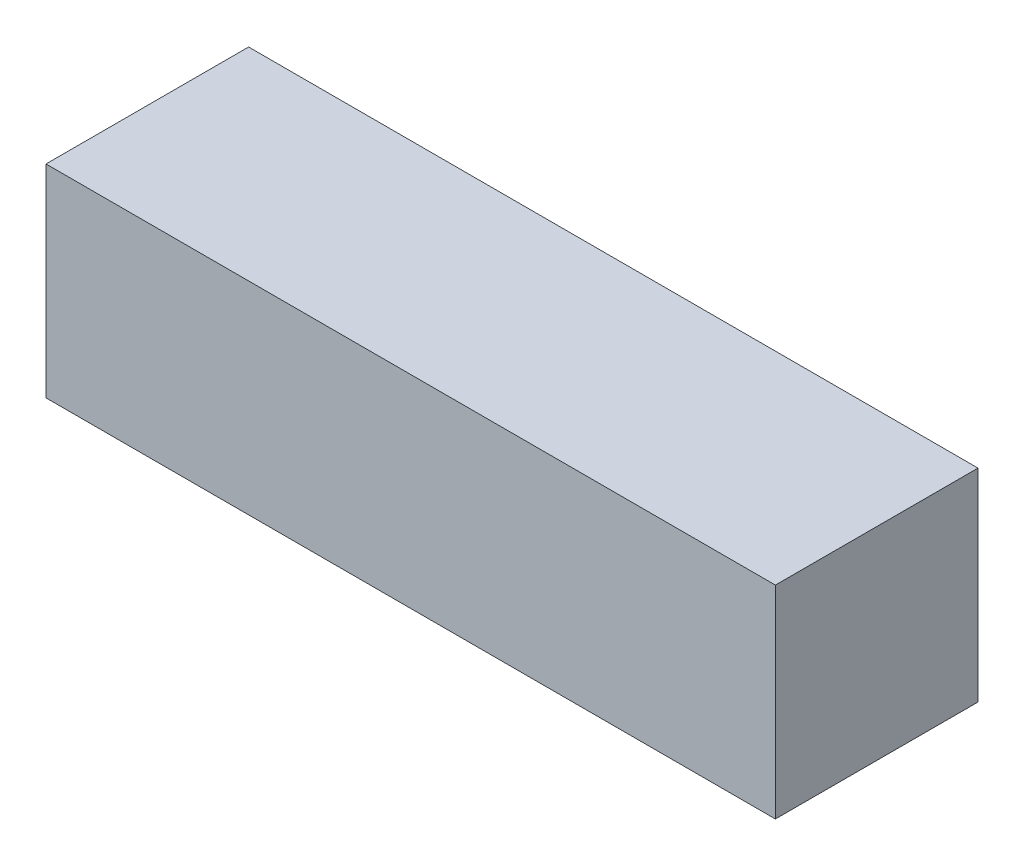
ISO-10303-21;
HEADER;
FILE_DESCRIPTION(('STEP AP214'),'2;1');
FILE_NAME('part.step','',(''),(''),'','','');
FILE_SCHEMA(('AUTOMOTIVE_DESIGN { 1 0 10303 214 1 1 1 1 }'));
ENDSEC;
DATA;
#1=APPLICATION_CONTEXT('core data for automotive mechanical design processes');
#2=APPLICATION_PROTOCOL_DEFINITION('international standard','automotive_design',2000,#1);
#3=PRODUCT_CONTEXT('',#1,'mechanical');
#4=PRODUCT('Part','Part','',(#3));
#5=PRODUCT_RELATED_PRODUCT_CATEGORY('part','',(#4));
#6=PRODUCT_DEFINITION_FORMATION('','',#4);
#7=PRODUCT_DEFINITION_CONTEXT('part definition',#1,'design');
#8=PRODUCT_DEFINITION('design','',#6,#7);
#9=PRODUCT_DEFINITION_SHAPE('','',#8);
#10=(LENGTH_UNIT() NAMED_UNIT(*) SI_UNIT(.MILLI.,.METRE.));
#11=(NAMED_UNIT(*) PLANE_ANGLE_UNIT() SI_UNIT($,.RADIAN.));
#12=(NAMED_UNIT(*) SI_UNIT($,.STERADIAN.) SOLID_ANGLE_UNIT());
#13=UNCERTAINTY_MEASURE_WITH_UNIT(LENGTH_MEASURE(1.E-05),#10,'distance_accuracy_value','');
#14=(GEOMETRIC_REPRESENTATION_CONTEXT(3) GLOBAL_UNCERTAINTY_ASSIGNED_CONTEXT((#13)) GLOBAL_UNIT_ASSIGNED_CONTEXT((#10,
#11,#12)) REPRESENTATION_CONTEXT('',''));
#15=CARTESIAN_POINT('',(0.,0.,0.));
#16=DIRECTION('',(0.,0.,1.));
#17=DIRECTION('',(1.,0.,0.));
#18=AXIS2_PLACEMENT_3D('',#15,#16,#17);
#19=CARTESIAN_POINT('',(-24.0943043801565,8.21370967741936,10.));
#20=DIRECTION('',(1.,0.,0.));
#21=DIRECTION('',(0.,1.,0.));
#22=AXIS2_PLACEMENT_3D('',#19,#20,#21);
#23=PLANE('',#22);
#24=DIRECTION('',(0.,-1.,0.));
#25=VECTOR('',#24,1.);
#26=CARTESIAN_POINT('',(-24.0943043801565,8.21370967741936,0.));
#27=LINE('',#26,#25);
#28=CARTESIAN_POINT('',(-24.0943043801565,8.21370967741936,0.));
#29=VERTEX_POINT('',#28);
#30=CARTESIAN_POINT('',(-24.0943043801565,-1.78629032258064,0.));
#31=VERTEX_POINT('',#30);
#32=EDGE_CURVE('E107',#29,#31,#27,.T.);
#33=ORIENTED_EDGE('',*,*,#32,.T.);
#34=DIRECTION('',(0.,0.,-1.));
#35=VECTOR('',#34,1.);
#36=CARTESIAN_POINT('',(-24.0943043801565,-1.78629032258064,10.));
#37=LINE('',#36,#35);
#38=CARTESIAN_POINT('',(-24.0943043801565,-1.78629032258064,10.));
#39=VERTEX_POINT('',#38);
#40=EDGE_CURVE('E11',#39,#31,#37,.T.);
#41=ORIENTED_EDGE('',*,*,#40,.F.);
#42=DIRECTION('',(0.,-1.,0.));
#43=VECTOR('',#42,1.);
#44=CARTESIAN_POINT('',(-24.0943043801565,8.21370967741936,10.));
#45=LINE('',#44,#43);
#46=CARTESIAN_POINT('',(-24.0943043801565,8.21370967741936,10.));
#47=VERTEX_POINT('',#46);
#48=EDGE_CURVE('E91',#47,#39,#45,.T.);
#49=ORIENTED_EDGE('',*,*,#48,.F.);
#50=DIRECTION('',(0.,0.,-1.));
#51=VECTOR('',#50,1.);
#52=CARTESIAN_POINT('',(-24.0943043801565,8.21370967741936,10.));
#53=LINE('',#52,#51);
#54=EDGE_CURVE('E103',#47,#29,#53,.T.);
#55=ORIENTED_EDGE('',*,*,#54,.T.);
#56=EDGE_LOOP('',(#33,#41,#49,#55));
#57=FACE_BOUND('',#56,.T.);
#58=ADVANCED_FACE('F39',(#57),#23,.F.);
#59=CARTESIAN_POINT('',(-24.0943043801565,-1.78629032258064,10.));
#60=DIRECTION('',(0.,1.,0.));
#61=DIRECTION('',(0.,0.,1.));
#62=AXIS2_PLACEMENT_3D('',#59,#60,#61);
#63=PLANE('',#62);
#64=DIRECTION('',(1.,0.,0.));
#65=VECTOR('',#64,1.);
#66=CARTESIAN_POINT('',(-24.0943043801565,-1.78629032258064,0.));
#67=LINE('',#66,#65);
#68=CARTESIAN_POINT('',(11.9056956198435,-1.78629032258064,0.));
#69=VERTEX_POINT('',#68);
#70=EDGE_CURVE('E96',#31,#69,#67,.T.);
#71=ORIENTED_EDGE('',*,*,#70,.T.);
#72=DIRECTION('',(0.,0.,-1.));
#73=VECTOR('',#72,1.);
#74=CARTESIAN_POINT('',(11.9056956198435,-1.78629032258064,10.));
#75=LINE('',#74,#73);
#76=CARTESIAN_POINT('',(11.9056956198435,-1.78629032258064,10.));
#77=VERTEX_POINT('',#76);
#78=EDGE_CURVE('E48',#77,#69,#75,.T.);
#79=ORIENTED_EDGE('',*,*,#78,.F.);
#80=DIRECTION('',(1.,0.,0.));
#81=VECTOR('',#80,1.);
#82=CARTESIAN_POINT('',(-24.0943043801565,-1.78629032258064,10.));
#83=LINE('',#82,#81);
#84=EDGE_CURVE('E86',#39,#77,#83,.T.);
#85=ORIENTED_EDGE('',*,*,#84,.F.);
#86=ORIENTED_EDGE('',*,*,#40,.T.);
#87=EDGE_LOOP('',(#71,#79,#85,#86));
#88=FACE_BOUND('',#87,.T.);
#89=ADVANCED_FACE('F95',(#88),#63,.F.);
#90=CARTESIAN_POINT('',(11.9056956198435,8.21370967741936,10.));
#91=DIRECTION('',(-1.,0.,0.));
#92=DIRECTION('',(0.,-1.,0.));
#93=AXIS2_PLACEMENT_3D('',#90,#91,#92);
#94=PLANE('',#93);
#95=DIRECTION('',(0.,1.,0.));
#96=VECTOR('',#95,1.);
#97=CARTESIAN_POINT('',(11.9056956198435,8.21370967741936,0.));
#98=LINE('',#97,#96);
#99=CARTESIAN_POINT('',(11.9056956198435,8.21370967741936,0.));
#100=VERTEX_POINT('',#99);
#101=EDGE_CURVE('E73',#69,#100,#98,.T.);
#102=ORIENTED_EDGE('',*,*,#101,.T.);
#103=DIRECTION('',(0.,0.,-1.));
#104=VECTOR('',#103,1.);
#105=CARTESIAN_POINT('',(11.9056956198435,8.21370967741936,10.));
#106=LINE('',#105,#104);
#107=CARTESIAN_POINT('',(11.9056956198435,8.21370967741936,10.));
#108=VERTEX_POINT('',#107);
#109=EDGE_CURVE('E98',#108,#100,#106,.T.);
#110=ORIENTED_EDGE('',*,*,#109,.F.);
#111=DIRECTION('',(0.,1.,0.));
#112=VECTOR('',#111,1.);
#113=CARTESIAN_POINT('',(11.9056956198435,8.21370967741936,10.));
#114=LINE('',#113,#112);
#115=EDGE_CURVE('E89',#77,#108,#114,.T.);
#116=ORIENTED_EDGE('',*,*,#115,.F.);
#117=ORIENTED_EDGE('',*,*,#78,.T.);
#118=EDGE_LOOP('',(#102,#110,#116,#117));
#119=FACE_BOUND('',#118,.T.);
#120=ADVANCED_FACE('F99',(#119),#94,.F.);
#121=CARTESIAN_POINT('',(-24.0943043801565,8.21370967741936,10.));
#122=DIRECTION('',(0.,-1.,0.));
#123=DIRECTION('',(0.,0.,-1.));
#124=AXIS2_PLACEMENT_3D('',#121,#122,#123);
#125=PLANE('',#124);
#126=DIRECTION('',(-1.,0.,0.));
#127=VECTOR('',#126,1.);
#128=CARTESIAN_POINT('',(-24.0943043801565,8.21370967741936,0.));
#129=LINE('',#128,#127);
#130=EDGE_CURVE('E79',#100,#29,#129,.T.);
#131=ORIENTED_EDGE('',*,*,#130,.T.);
#132=ORIENTED_EDGE('',*,*,#54,.F.);
#133=DIRECTION('',(-1.,0.,0.));
#134=VECTOR('',#133,1.);
#135=CARTESIAN_POINT('',(-24.0943043801565,8.21370967741936,10.));
#136=LINE('',#135,#134);
#137=EDGE_CURVE('E56',#108,#47,#136,.T.);
#138=ORIENTED_EDGE('',*,*,#137,.F.);
#139=ORIENTED_EDGE('',*,*,#109,.T.);
#140=EDGE_LOOP('',(#131,#132,#138,#139));
#141=FACE_BOUND('',#140,.T.);
#142=ADVANCED_FACE('F120',(#141),#125,.F.);
#143=CARTESIAN_POINT('',(0.,0.,10.));
#144=DIRECTION('',(0.,0.,1.));
#145=DIRECTION('',(1.,0.,0.));
#146=AXIS2_PLACEMENT_3D('',#143,#144,#145);
#147=PLANE('',#146);
#148=ORIENTED_EDGE('',*,*,#48,.T.);
#149=ORIENTED_EDGE('',*,*,#84,.T.);
#150=ORIENTED_EDGE('',*,*,#115,.T.);
#151=ORIENTED_EDGE('',*,*,#137,.T.);
#152=EDGE_LOOP('',(#148,#149,#150,#151));
#153=FACE_BOUND('',#152,.T.);
#154=ADVANCED_FACE('F87',(#153),#147,.T.);
#155=CARTESIAN_POINT('',(0.,0.,0.));
#156=DIRECTION('',(0.,0.,1.));
#157=DIRECTION('',(1.,0.,0.));
#158=AXIS2_PLACEMENT_3D('',#155,#156,#157);
#159=PLANE('',#158);
#160=ORIENTED_EDGE('',*,*,#32,.F.);
#161=ORIENTED_EDGE('',*,*,#130,.F.);
#162=ORIENTED_EDGE('',*,*,#101,.F.);
#163=ORIENTED_EDGE('',*,*,#70,.F.);
#164=EDGE_LOOP('',(#160,#161,#162,#163));
#165=FACE_BOUND('',#164,.T.);
#166=ADVANCED_FACE('F123',(#165),#159,.F.);
#167=CLOSED_SHELL('',(#58,#89,#120,#142,#154,#166));
#168=MANIFOLD_SOLID_BREP('B2',#167);
#169=ADVANCED_BREP_SHAPE_REPRESENTATION('',(#18,#168),#14);
#170=SHAPE_DEFINITION_REPRESENTATION(#9,#169);
ENDSEC;
END-ISO-10303-21;
